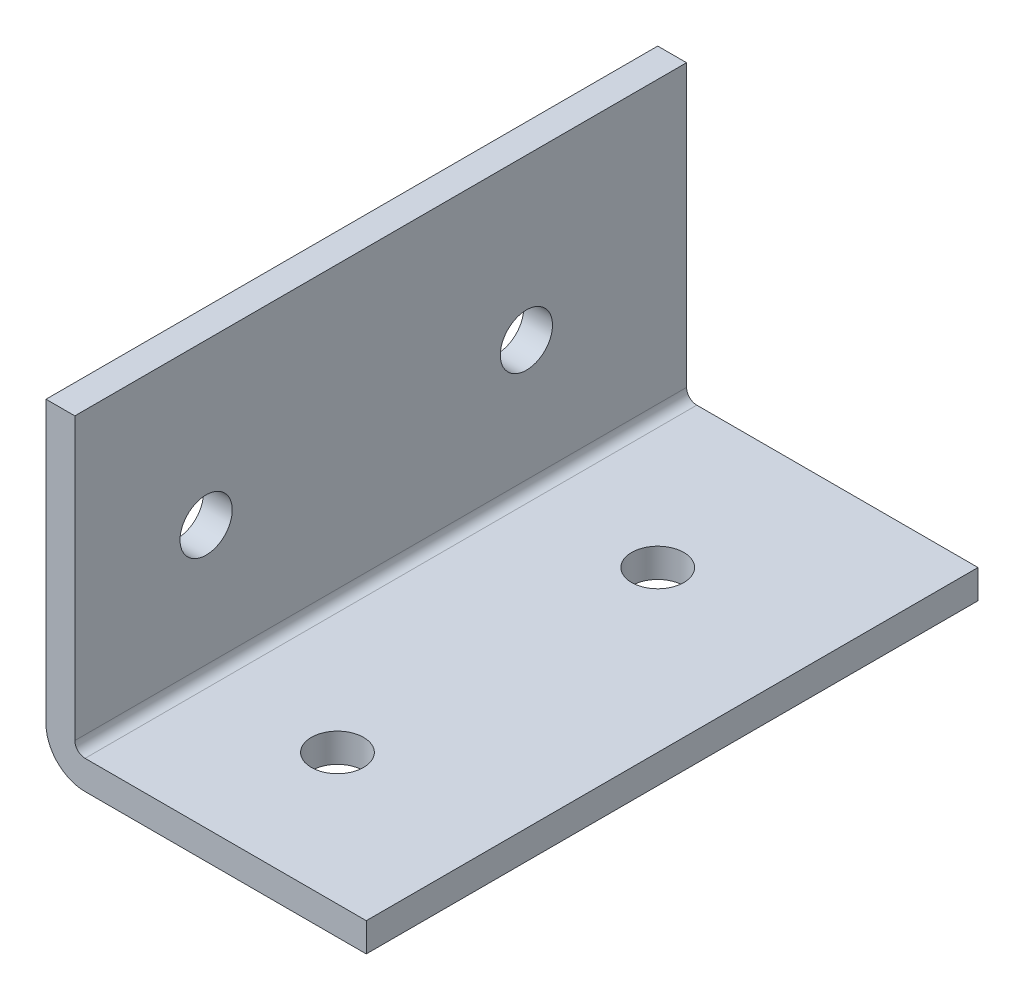
ISO-10303-21;
HEADER;
FILE_DESCRIPTION(('STEP AP214'),'2;1');
FILE_NAME('part.step','',(''),(''),'','','');
FILE_SCHEMA(('AUTOMOTIVE_DESIGN { 1 0 10303 214 1 1 1 1 }'));
ENDSEC;
DATA;
#1=APPLICATION_CONTEXT('core data for automotive mechanical design processes');
#2=APPLICATION_PROTOCOL_DEFINITION('international standard','automotive_design',2000,#1);
#3=PRODUCT_CONTEXT('',#1,'mechanical');
#4=PRODUCT('Part','Part','',(#3));
#5=PRODUCT_RELATED_PRODUCT_CATEGORY('part','',(#4));
#6=PRODUCT_DEFINITION_FORMATION('','',#4);
#7=PRODUCT_DEFINITION_CONTEXT('part definition',#1,'design');
#8=PRODUCT_DEFINITION('design','',#6,#7);
#9=PRODUCT_DEFINITION_SHAPE('','',#8);
#10=(LENGTH_UNIT() NAMED_UNIT(*) SI_UNIT(.MILLI.,.METRE.));
#11=(NAMED_UNIT(*) PLANE_ANGLE_UNIT() SI_UNIT($,.RADIAN.));
#12=(NAMED_UNIT(*) SI_UNIT($,.STERADIAN.) SOLID_ANGLE_UNIT());
#13=UNCERTAINTY_MEASURE_WITH_UNIT(LENGTH_MEASURE(1.E-05),#10,'distance_accuracy_value','');
#14=(GEOMETRIC_REPRESENTATION_CONTEXT(3) GLOBAL_UNCERTAINTY_ASSIGNED_CONTEXT((#13)) GLOBAL_UNIT_ASSIGNED_CONTEXT((#10,
#11,#12)) REPRESENTATION_CONTEXT('',''));
#15=CARTESIAN_POINT('',(0.,0.,0.));
#16=DIRECTION('',(0.,0.,1.));
#17=DIRECTION('',(1.,0.,0.));
#18=AXIS2_PLACEMENT_3D('',#15,#16,#17);
#19=CARTESIAN_POINT('',(25.4,0.,-749.3));
#20=DIRECTION('',(0.,-1.,0.));
#21=DIRECTION('',(0.,0.,-1.));
#22=AXIS2_PLACEMENT_3D('',#19,#20,#21);
#23=PLANE('',#22);
#24=DIRECTION('',(1.,0.,0.));
#25=VECTOR('',#24,1.);
#26=CARTESIAN_POINT('',(25.4,0.,-624.586));
#27=LINE('',#26,#25);
#28=CARTESIAN_POINT('',(3.0988,0.,-624.586));
#29=VERTEX_POINT('',#28);
#30=CARTESIAN_POINT('',(25.4,0.,-624.586));
#31=VERTEX_POINT('',#30);
#32=EDGE_CURVE('E99',#29,#31,#27,.T.);
#33=ORIENTED_EDGE('',*,*,#32,.F.);
#34=DIRECTION('',(0.,0.,1.));
#35=VECTOR('',#34,1.);
#36=CARTESIAN_POINT('',(3.0988,0.,-749.3));
#37=LINE('',#36,#35);
#38=CARTESIAN_POINT('',(3.0988,0.,-673.1));
#39=VERTEX_POINT('',#38);
#40=EDGE_CURVE('E57',#29,#39,#37,.F.);
#41=ORIENTED_EDGE('',*,*,#40,.T.);
#42=DIRECTION('',(1.,0.,0.));
#43=VECTOR('',#42,1.);
#44=CARTESIAN_POINT('',(25.4,0.,-673.1));
#45=LINE('',#44,#43);
#46=CARTESIAN_POINT('',(25.4,0.,-673.1));
#47=VERTEX_POINT('',#46);
#48=EDGE_CURVE('E162',#39,#47,#45,.T.);
#49=ORIENTED_EDGE('',*,*,#48,.T.);
#50=DIRECTION('',(0.,0.,1.));
#51=VECTOR('',#50,1.);
#52=CARTESIAN_POINT('',(25.4,0.,-749.3));
#53=LINE('',#52,#51);
#54=EDGE_CURVE('E107',#47,#31,#53,.T.);
#55=ORIENTED_EDGE('',*,*,#54,.T.);
#56=EDGE_LOOP('',(#33,#41,#49,#55));
#57=FACE_BOUND('',#56,.T.);
#58=CARTESIAN_POINT('',(12.7,0.,-635.));
#59=DIRECTION('',(0.,-1.,0.));
#60=DIRECTION('',(0.,0.,-1.));
#61=AXIS2_PLACEMENT_3D('',#58,#59,#60);
#62=CIRCLE('',#61,2.07009999999995);
#63=CARTESIAN_POINT('',(12.7,0.,-637.0701));
#64=VERTEX_POINT('',#63);
#65=EDGE_CURVE('E131',#64,#64,#62,.T.);
#66=ORIENTED_EDGE('',*,*,#65,.F.);
#67=EDGE_LOOP('',(#66));
#68=FACE_BOUND('',#67,.T.);
#69=CARTESIAN_POINT('',(12.7,0.,-660.4));
#70=DIRECTION('',(0.,-1.,0.));
#71=DIRECTION('',(0.,0.,-1.));
#72=AXIS2_PLACEMENT_3D('',#69,#70,#71);
#73=CIRCLE('',#72,2.07009999999995);
#74=CARTESIAN_POINT('',(12.7,0.,-662.4701));
#75=VERTEX_POINT('',#74);
#76=EDGE_CURVE('E137',#75,#75,#73,.T.);
#77=ORIENTED_EDGE('',*,*,#76,.F.);
#78=EDGE_LOOP('',(#77));
#79=FACE_BOUND('',#78,.T.);
#80=ADVANCED_FACE('F35',(#57,#68,#79),#23,.T.);
#81=CARTESIAN_POINT('',(25.4,25.4,749.3));
#82=DIRECTION('',(0.,1.,0.));
#83=DIRECTION('',(0.,0.,1.));
#84=AXIS2_PLACEMENT_3D('',#81,#82,#83);
#85=PLANE('',#84);
#86=DIRECTION('',(-1.,0.,0.));
#87=VECTOR('',#86,1.);
#88=CARTESIAN_POINT('',(25.4,25.4,-624.586));
#89=LINE('',#88,#87);
#90=CARTESIAN_POINT('',(2.286,25.4,-624.586));
#91=VERTEX_POINT('',#90);
#92=CARTESIAN_POINT('',(0.,25.4000000000002,-624.586));
#93=VERTEX_POINT('',#92);
#94=EDGE_CURVE('E109',#91,#93,#89,.T.);
#95=ORIENTED_EDGE('',*,*,#94,.F.);
#96=DIRECTION('',(0.,0.,-1.));
#97=VECTOR('',#96,1.);
#98=CARTESIAN_POINT('',(2.286,25.4,749.3));
#99=LINE('',#98,#97);
#100=CARTESIAN_POINT('',(2.286,25.4,-673.1));
#101=VERTEX_POINT('',#100);
#102=EDGE_CURVE('E123',#91,#101,#99,.T.);
#103=ORIENTED_EDGE('',*,*,#102,.T.);
#104=DIRECTION('',(-1.,0.,0.));
#105=VECTOR('',#104,1.);
#106=CARTESIAN_POINT('',(25.4,25.4,-673.1));
#107=LINE('',#106,#105);
#108=CARTESIAN_POINT('',(0.,25.4000000000002,-673.1));
#109=VERTEX_POINT('',#108);
#110=EDGE_CURVE('E164',#101,#109,#107,.T.);
#111=ORIENTED_EDGE('',*,*,#110,.T.);
#112=DIRECTION('',(0.,0.,-1.));
#113=VECTOR('',#112,1.);
#114=CARTESIAN_POINT('',(0.,25.4,749.3));
#115=LINE('',#114,#113);
#116=EDGE_CURVE('E121',#93,#109,#115,.T.);
#117=ORIENTED_EDGE('',*,*,#116,.F.);
#118=EDGE_LOOP('',(#95,#103,#111,#117));
#119=FACE_BOUND('',#118,.T.);
#120=ADVANCED_FACE('F189',(#119),#85,.T.);
#121=CARTESIAN_POINT('',(25.4,0.,0.));
#122=DIRECTION('',(-1.,0.,0.));
#123=DIRECTION('',(0.,0.,1.));
#124=AXIS2_PLACEMENT_3D('',#121,#122,#123);
#125=PLANE('',#124);
#126=DIRECTION('',(0.,0.,-1.));
#127=VECTOR('',#126,1.);
#128=CARTESIAN_POINT('',(25.4,2.286,749.3));
#129=LINE('',#128,#127);
#130=CARTESIAN_POINT('',(25.4,2.286,-624.586));
#131=VERTEX_POINT('',#130);
#132=CARTESIAN_POINT('',(25.4,2.286,-673.1));
#133=VERTEX_POINT('',#132);
#134=EDGE_CURVE('E125',#131,#133,#129,.T.);
#135=ORIENTED_EDGE('',*,*,#134,.F.);
#136=DIRECTION('',(0.,-1.,0.));
#137=VECTOR('',#136,1.);
#138=CARTESIAN_POINT('',(25.4,0.,-624.586));
#139=LINE('',#138,#137);
#140=EDGE_CURVE('E176',#131,#31,#139,.T.);
#141=ORIENTED_EDGE('',*,*,#140,.T.);
#142=ORIENTED_EDGE('',*,*,#54,.F.);
#143=DIRECTION('',(0.,-1.,0.));
#144=VECTOR('',#143,1.);
#145=CARTESIAN_POINT('',(25.4,0.,-673.1));
#146=LINE('',#145,#144);
#147=EDGE_CURVE('E157',#133,#47,#146,.T.);
#148=ORIENTED_EDGE('',*,*,#147,.F.);
#149=EDGE_LOOP('',(#135,#141,#142,#148));
#150=FACE_BOUND('',#149,.T.);
#151=ADVANCED_FACE('F207',(#150),#125,.F.);
#152=CARTESIAN_POINT('',(0.,0.,0.));
#153=DIRECTION('',(-1.,0.,0.));
#154=DIRECTION('',(0.,0.,1.));
#155=AXIS2_PLACEMENT_3D('',#152,#153,#154);
#156=PLANE('',#155);
#157=DIRECTION('',(0.,-1.,0.));
#158=VECTOR('',#157,1.);
#159=CARTESIAN_POINT('',(0.,0.,-624.586));
#160=LINE('',#159,#158);
#161=CARTESIAN_POINT('',(0.,3.0988,-624.586));
#162=VERTEX_POINT('',#161);
#163=EDGE_CURVE('E49',#93,#162,#160,.T.);
#164=ORIENTED_EDGE('',*,*,#163,.F.);
#165=ORIENTED_EDGE('',*,*,#116,.T.);
#166=DIRECTION('',(0.,-1.,0.));
#167=VECTOR('',#166,1.);
#168=CARTESIAN_POINT('',(0.,0.,-673.1));
#169=LINE('',#168,#167);
#170=CARTESIAN_POINT('',(0.,3.0988,-673.1));
#171=VERTEX_POINT('',#170);
#172=EDGE_CURVE('E167',#109,#171,#169,.T.);
#173=ORIENTED_EDGE('',*,*,#172,.T.);
#174=DIRECTION('',(0.,0.,1.));
#175=VECTOR('',#174,1.);
#176=CARTESIAN_POINT('',(0.,3.0988,0.));
#177=LINE('',#176,#175);
#178=EDGE_CURVE('E112',#171,#162,#177,.T.);
#179=ORIENTED_EDGE('',*,*,#178,.T.);
#180=EDGE_LOOP('',(#164,#165,#173,#179));
#181=FACE_BOUND('',#180,.T.);
#182=CARTESIAN_POINT('',(0.,12.7,-660.4));
#183=DIRECTION('',(-1.,0.,0.));
#184=DIRECTION('',(0.,0.,1.));
#185=AXIS2_PLACEMENT_3D('',#182,#183,#184);
#186=CIRCLE('',#185,2.07009999999995);
#187=CARTESIAN_POINT('',(0.,12.7,-658.3299));
#188=VERTEX_POINT('',#187);
#189=EDGE_CURVE('E143',#188,#188,#186,.T.);
#190=ORIENTED_EDGE('',*,*,#189,.F.);
#191=EDGE_LOOP('',(#190));
#192=FACE_BOUND('',#191,.T.);
#193=CARTESIAN_POINT('',(0.,12.7,-635.));
#194=DIRECTION('',(-1.,0.,0.));
#195=DIRECTION('',(0.,0.,1.));
#196=AXIS2_PLACEMENT_3D('',#193,#194,#195);
#197=CIRCLE('',#196,2.07009999999995);
#198=CARTESIAN_POINT('',(0.,12.7,-632.9299));
#199=VERTEX_POINT('',#198);
#200=EDGE_CURVE('E149',#199,#199,#197,.T.);
#201=ORIENTED_EDGE('',*,*,#200,.F.);
#202=EDGE_LOOP('',(#201));
#203=FACE_BOUND('',#202,.T.);
#204=ADVANCED_FACE('F186',(#181,#192,#203),#156,.T.);
#205=CARTESIAN_POINT('',(2.286,2.286,749.3));
#206=DIRECTION('',(-1.,0.,0.));
#207=DIRECTION('',(0.,0.,1.));
#208=AXIS2_PLACEMENT_3D('',#205,#206,#207);
#209=PLANE('',#208);
#210=CARTESIAN_POINT('',(2.286,12.7,-660.4));
#211=DIRECTION('',(-1.,0.,0.));
#212=DIRECTION('',(0.,0.,1.));
#213=AXIS2_PLACEMENT_3D('',#210,#211,#212);
#214=CIRCLE('',#213,2.07009999999995);
#215=CARTESIAN_POINT('',(2.286,12.7,-658.3299));
#216=VERTEX_POINT('',#215);
#217=EDGE_CURVE('E140',#216,#216,#214,.T.);
#218=ORIENTED_EDGE('',*,*,#217,.T.);
#219=EDGE_LOOP('',(#218));
#220=FACE_BOUND('',#219,.T.);
#221=CARTESIAN_POINT('',(2.286,12.7,-635.));
#222=DIRECTION('',(-1.,0.,0.));
#223=DIRECTION('',(0.,0.,1.));
#224=AXIS2_PLACEMENT_3D('',#221,#222,#223);
#225=CIRCLE('',#224,2.07009999999995);
#226=CARTESIAN_POINT('',(2.286,12.7,-632.9299));
#227=VERTEX_POINT('',#226);
#228=EDGE_CURVE('E146',#227,#227,#225,.T.);
#229=ORIENTED_EDGE('',*,*,#228,.T.);
#230=EDGE_LOOP('',(#229));
#231=FACE_BOUND('',#230,.T.);
#232=ORIENTED_EDGE('',*,*,#102,.F.);
#233=DIRECTION('',(0.,-1.,0.));
#234=VECTOR('',#233,1.);
#235=CARTESIAN_POINT('',(2.286,2.286,-624.586));
#236=LINE('',#235,#234);
#237=CARTESIAN_POINT('',(2.286,3.0988,-624.586));
#238=VERTEX_POINT('',#237);
#239=EDGE_CURVE('E108',#91,#238,#236,.T.);
#240=ORIENTED_EDGE('',*,*,#239,.T.);
#241=DIRECTION('',(0.,0.,-1.));
#242=VECTOR('',#241,1.);
#243=CARTESIAN_POINT('',(2.286,3.0988,-749.3));
#244=LINE('',#243,#242);
#245=CARTESIAN_POINT('',(2.286,3.0988,-673.1));
#246=VERTEX_POINT('',#245);
#247=EDGE_CURVE('E119',#238,#246,#244,.T.);
#248=ORIENTED_EDGE('',*,*,#247,.T.);
#249=DIRECTION('',(0.,-1.,0.));
#250=VECTOR('',#249,1.);
#251=CARTESIAN_POINT('',(2.286,2.286,-673.1));
#252=LINE('',#251,#250);
#253=EDGE_CURVE('E159',#101,#246,#252,.T.);
#254=ORIENTED_EDGE('',*,*,#253,.F.);
#255=EDGE_LOOP('',(#232,#240,#248,#254));
#256=FACE_BOUND('',#255,.T.);
#257=ADVANCED_FACE('F196',(#220,#231,#256),#209,.F.);
#258=CARTESIAN_POINT('',(25.4,2.286,749.3));
#259=DIRECTION('',(0.,-1.,0.));
#260=DIRECTION('',(0.,0.,-1.));
#261=AXIS2_PLACEMENT_3D('',#258,#259,#260);
#262=PLANE('',#261);
#263=CARTESIAN_POINT('',(12.7,2.286,-635.));
#264=DIRECTION('',(0.,-1.,0.));
#265=DIRECTION('',(0.,0.,-1.));
#266=AXIS2_PLACEMENT_3D('',#263,#264,#265);
#267=CIRCLE('',#266,2.07009999999995);
#268=CARTESIAN_POINT('',(12.7,2.286,-637.0701));
#269=VERTEX_POINT('',#268);
#270=EDGE_CURVE('E127',#269,#269,#267,.T.);
#271=ORIENTED_EDGE('',*,*,#270,.T.);
#272=EDGE_LOOP('',(#271));
#273=FACE_BOUND('',#272,.T.);
#274=CARTESIAN_POINT('',(12.7,2.286,-660.4));
#275=DIRECTION('',(0.,-1.,0.));
#276=DIRECTION('',(0.,0.,-1.));
#277=AXIS2_PLACEMENT_3D('',#274,#275,#276);
#278=CIRCLE('',#277,2.07009999999995);
#279=CARTESIAN_POINT('',(12.7,2.286,-662.4701));
#280=VERTEX_POINT('',#279);
#281=EDGE_CURVE('E134',#280,#280,#278,.T.);
#282=ORIENTED_EDGE('',*,*,#281,.T.);
#283=EDGE_LOOP('',(#282));
#284=FACE_BOUND('',#283,.T.);
#285=DIRECTION('',(0.,0.,-1.));
#286=VECTOR('',#285,1.);
#287=CARTESIAN_POINT('',(3.0988,2.286,749.3));
#288=LINE('',#287,#286);
#289=CARTESIAN_POINT('',(3.0988,2.286,-673.1));
#290=VERTEX_POINT('',#289);
#291=CARTESIAN_POINT('',(3.0988,2.286,-624.586));
#292=VERTEX_POINT('',#291);
#293=EDGE_CURVE('E114',#290,#292,#288,.F.);
#294=ORIENTED_EDGE('',*,*,#293,.T.);
#295=DIRECTION('',(1.,0.,0.));
#296=VECTOR('',#295,1.);
#297=CARTESIAN_POINT('',(25.4,2.286,-624.586));
#298=LINE('',#297,#296);
#299=EDGE_CURVE('E170',#292,#131,#298,.T.);
#300=ORIENTED_EDGE('',*,*,#299,.T.);
#301=ORIENTED_EDGE('',*,*,#134,.T.);
#302=DIRECTION('',(1.,0.,0.));
#303=VECTOR('',#302,1.);
#304=CARTESIAN_POINT('',(25.4,2.286,-673.1));
#305=LINE('',#304,#303);
#306=EDGE_CURVE('E152',#290,#133,#305,.T.);
#307=ORIENTED_EDGE('',*,*,#306,.F.);
#308=EDGE_LOOP('',(#294,#300,#301,#307));
#309=FACE_BOUND('',#308,.T.);
#310=ADVANCED_FACE('F204',(#273,#284,#309),#262,.F.);
#311=CARTESIAN_POINT('',(3.0988,3.0988,749.3));
#312=DIRECTION('',(0.,0.,1.));
#313=DIRECTION('',(1.,0.,0.));
#314=AXIS2_PLACEMENT_3D('',#311,#312,#313);
#315=CYLINDRICAL_SURFACE('',#314,0.8128);
#316=ORIENTED_EDGE('',*,*,#247,.F.);
#317=CARTESIAN_POINT('',(3.0988,3.0988,-624.586));
#318=DIRECTION('',(0.,0.,-1.));
#319=DIRECTION('',(-1.,0.,0.));
#320=AXIS2_PLACEMENT_3D('',#317,#318,#319);
#321=CIRCLE('',#320,0.8128);
#322=EDGE_CURVE('E173',#238,#292,#321,.F.);
#323=ORIENTED_EDGE('',*,*,#322,.T.);
#324=ORIENTED_EDGE('',*,*,#293,.F.);
#325=CARTESIAN_POINT('',(3.0988,3.0988,-673.1));
#326=DIRECTION('',(0.,0.,-1.));
#327=DIRECTION('',(-1.,0.,0.));
#328=AXIS2_PLACEMENT_3D('',#325,#326,#327);
#329=CIRCLE('',#328,0.8128);
#330=EDGE_CURVE('E155',#246,#290,#329,.F.);
#331=ORIENTED_EDGE('',*,*,#330,.F.);
#332=EDGE_LOOP('',(#316,#323,#324,#331));
#333=FACE_BOUND('',#332,.T.);
#334=ADVANCED_FACE('F199',(#333),#315,.F.);
#335=CARTESIAN_POINT('',(3.0988,3.0988,0.));
#336=DIRECTION('',(0.,0.,1.));
#337=DIRECTION('',(1.,0.,0.));
#338=AXIS2_PLACEMENT_3D('',#335,#336,#337);
#339=CYLINDRICAL_SURFACE('',#338,3.0988);
#340=CARTESIAN_POINT('',(3.0988,3.0988,-624.586));
#341=DIRECTION('',(0.,0.,-1.));
#342=DIRECTION('',(-1.,0.,0.));
#343=AXIS2_PLACEMENT_3D('',#340,#341,#342);
#344=CIRCLE('',#343,3.0988);
#345=EDGE_CURVE('E11',#162,#29,#344,.F.);
#346=ORIENTED_EDGE('',*,*,#345,.F.);
#347=ORIENTED_EDGE('',*,*,#178,.F.);
#348=CARTESIAN_POINT('',(3.0988,3.0988,-673.1));
#349=DIRECTION('',(0.,0.,-1.));
#350=DIRECTION('',(-1.,0.,0.));
#351=AXIS2_PLACEMENT_3D('',#348,#349,#350);
#352=CIRCLE('',#351,3.0988);
#353=EDGE_CURVE('E43',#171,#39,#352,.F.);
#354=ORIENTED_EDGE('',*,*,#353,.T.);
#355=ORIENTED_EDGE('',*,*,#40,.F.);
#356=EDGE_LOOP('',(#346,#347,#354,#355));
#357=FACE_BOUND('',#356,.T.);
#358=ADVANCED_FACE('F37',(#357),#339,.T.);
#359=CARTESIAN_POINT('',(12.7,0.,-635.));
#360=DIRECTION('',(0.,-1.,0.));
#361=DIRECTION('',(0.,0.,-1.));
#362=AXIS2_PLACEMENT_3D('',#359,#360,#361);
#363=CYLINDRICAL_SURFACE('',#362,2.07009999999995);
#364=ORIENTED_EDGE('',*,*,#65,.T.);
#365=EDGE_LOOP('',(#364));
#366=FACE_BOUND('',#365,.T.);
#367=ORIENTED_EDGE('',*,*,#270,.F.);
#368=EDGE_LOOP('',(#367));
#369=FACE_BOUND('',#368,.T.);
#370=ADVANCED_FACE('F227',(#366,#369),#363,.F.);
#371=CARTESIAN_POINT('',(12.7,0.,-660.4));
#372=DIRECTION('',(0.,-1.,0.));
#373=DIRECTION('',(0.,0.,-1.));
#374=AXIS2_PLACEMENT_3D('',#371,#372,#373);
#375=CYLINDRICAL_SURFACE('',#374,2.07009999999995);
#376=ORIENTED_EDGE('',*,*,#76,.T.);
#377=EDGE_LOOP('',(#376));
#378=FACE_BOUND('',#377,.T.);
#379=ORIENTED_EDGE('',*,*,#281,.F.);
#380=EDGE_LOOP('',(#379));
#381=FACE_BOUND('',#380,.T.);
#382=ADVANCED_FACE('F238',(#378,#381),#375,.F.);
#383=CARTESIAN_POINT('',(0.,12.7,-660.4));
#384=DIRECTION('',(-1.,0.,0.));
#385=DIRECTION('',(0.,0.,1.));
#386=AXIS2_PLACEMENT_3D('',#383,#384,#385);
#387=CYLINDRICAL_SURFACE('',#386,2.07009999999995);
#388=ORIENTED_EDGE('',*,*,#189,.T.);
#389=EDGE_LOOP('',(#388));
#390=FACE_BOUND('',#389,.T.);
#391=ORIENTED_EDGE('',*,*,#217,.F.);
#392=EDGE_LOOP('',(#391));
#393=FACE_BOUND('',#392,.T.);
#394=ADVANCED_FACE('F242',(#390,#393),#387,.F.);
#395=CARTESIAN_POINT('',(0.,12.7,-635.));
#396=DIRECTION('',(-1.,0.,0.));
#397=DIRECTION('',(0.,0.,1.));
#398=AXIS2_PLACEMENT_3D('',#395,#396,#397);
#399=CYLINDRICAL_SURFACE('',#398,2.07009999999995);
#400=ORIENTED_EDGE('',*,*,#200,.T.);
#401=EDGE_LOOP('',(#400));
#402=FACE_BOUND('',#401,.T.);
#403=ORIENTED_EDGE('',*,*,#228,.F.);
#404=EDGE_LOOP('',(#403));
#405=FACE_BOUND('',#404,.T.);
#406=ADVANCED_FACE('F246',(#402,#405),#399,.F.);
#407=CARTESIAN_POINT('',(0.,0.,-673.1));
#408=DIRECTION('',(0.,0.,-1.));
#409=DIRECTION('',(-1.,0.,0.));
#410=AXIS2_PLACEMENT_3D('',#407,#408,#409);
#411=PLANE('',#410);
#412=ORIENTED_EDGE('',*,*,#306,.T.);
#413=ORIENTED_EDGE('',*,*,#147,.T.);
#414=ORIENTED_EDGE('',*,*,#48,.F.);
#415=ORIENTED_EDGE('',*,*,#353,.F.);
#416=ORIENTED_EDGE('',*,*,#172,.F.);
#417=ORIENTED_EDGE('',*,*,#110,.F.);
#418=ORIENTED_EDGE('',*,*,#253,.T.);
#419=ORIENTED_EDGE('',*,*,#330,.T.);
#420=EDGE_LOOP('',(#412,#413,#414,#415,#416,#417,#418,#419));
#421=FACE_BOUND('',#420,.T.);
#422=ADVANCED_FACE('F193',(#421),#411,.T.);
#423=CARTESIAN_POINT('',(0.,0.,-624.586));
#424=DIRECTION('',(0.,0.,-1.));
#425=DIRECTION('',(-1.,0.,0.));
#426=AXIS2_PLACEMENT_3D('',#423,#424,#425);
#427=PLANE('',#426);
#428=ORIENTED_EDGE('',*,*,#322,.F.);
#429=ORIENTED_EDGE('',*,*,#239,.F.);
#430=ORIENTED_EDGE('',*,*,#94,.T.);
#431=ORIENTED_EDGE('',*,*,#163,.T.);
#432=ORIENTED_EDGE('',*,*,#345,.T.);
#433=ORIENTED_EDGE('',*,*,#32,.T.);
#434=ORIENTED_EDGE('',*,*,#140,.F.);
#435=ORIENTED_EDGE('',*,*,#299,.F.);
#436=EDGE_LOOP('',(#428,#429,#430,#431,#432,#433,#434,#435));
#437=FACE_BOUND('',#436,.T.);
#438=ADVANCED_FACE('F98',(#437),#427,.F.);
#439=CLOSED_SHELL('',(#80,#120,#151,#204,#257,#310,#334,#358,#370,#382,#394,#406,#422,#438));
#440=MANIFOLD_SOLID_BREP('B2',#439);
#441=ADVANCED_BREP_SHAPE_REPRESENTATION('',(#18,#440),#14);
#442=SHAPE_DEFINITION_REPRESENTATION(#9,#441);
ENDSEC;
END-ISO-10303-21;
